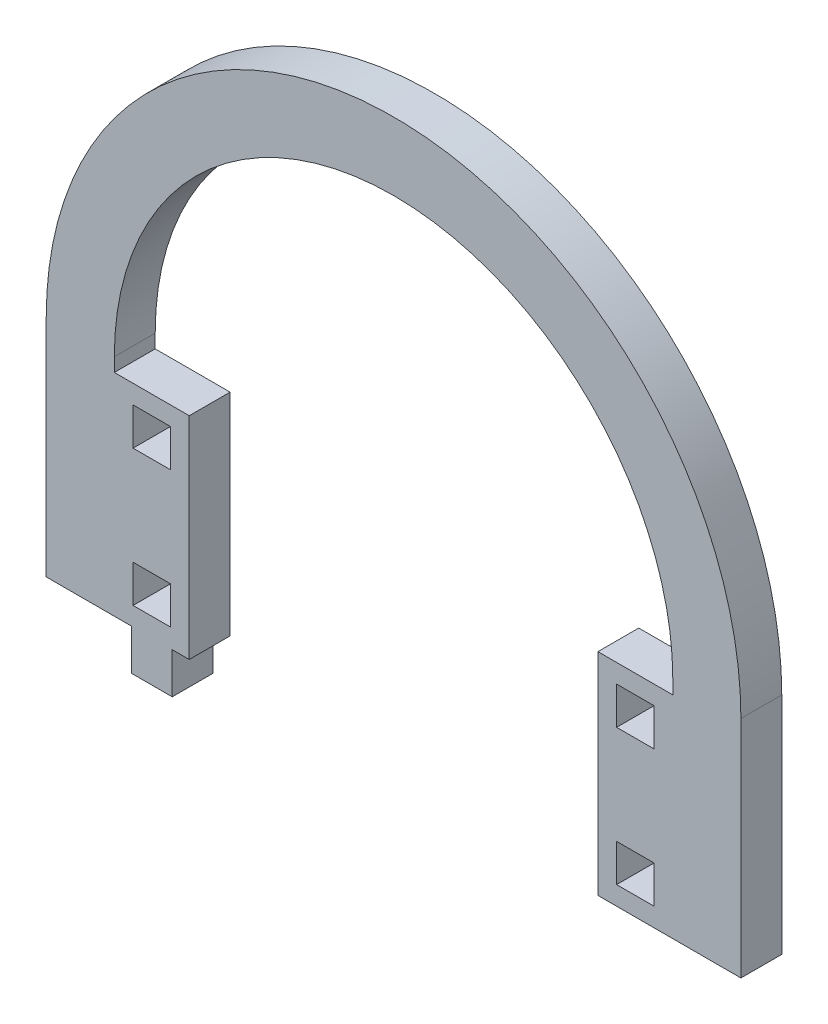
ISO-10303-21;
HEADER;
FILE_DESCRIPTION(('STEP AP214'),'2;1');
FILE_NAME('part.step','',(''),(''),'','','');
FILE_SCHEMA(('AUTOMOTIVE_DESIGN { 1 0 10303 214 1 1 1 1 }'));
ENDSEC;
DATA;
#1=APPLICATION_CONTEXT('core data for automotive mechanical design processes');
#2=APPLICATION_PROTOCOL_DEFINITION('international standard','automotive_design',2000,#1);
#3=PRODUCT_CONTEXT('',#1,'mechanical');
#4=PRODUCT('Part','Part','',(#3));
#5=PRODUCT_RELATED_PRODUCT_CATEGORY('part','',(#4));
#6=PRODUCT_DEFINITION_FORMATION('','',#4);
#7=PRODUCT_DEFINITION_CONTEXT('part definition',#1,'design');
#8=PRODUCT_DEFINITION('design','',#6,#7);
#9=PRODUCT_DEFINITION_SHAPE('','',#8);
#10=(LENGTH_UNIT() NAMED_UNIT(*) SI_UNIT(.MILLI.,.METRE.));
#11=(NAMED_UNIT(*) PLANE_ANGLE_UNIT() SI_UNIT($,.RADIAN.));
#12=(NAMED_UNIT(*) SI_UNIT($,.STERADIAN.) SOLID_ANGLE_UNIT());
#13=UNCERTAINTY_MEASURE_WITH_UNIT(LENGTH_MEASURE(1.E-05),#10,'distance_accuracy_value','');
#14=(GEOMETRIC_REPRESENTATION_CONTEXT(3) GLOBAL_UNCERTAINTY_ASSIGNED_CONTEXT((#13)) GLOBAL_UNIT_ASSIGNED_CONTEXT((#10,
#11,#12)) REPRESENTATION_CONTEXT('',''));
#15=CARTESIAN_POINT('',(0.,0.,0.));
#16=DIRECTION('',(0.,0.,1.));
#17=DIRECTION('',(1.,0.,0.));
#18=AXIS2_PLACEMENT_3D('',#15,#16,#17);
#19=CARTESIAN_POINT('',(3418.68426311956,1328.90302757437,6.));
#20=DIRECTION('',(0.,0.,1.));
#21=DIRECTION('',(1.,0.,0.));
#22=AXIS2_PLACEMENT_3D('',#19,#20,#21);
#23=PLANE('',#22);
#24=CARTESIAN_POINT('',(3418.68426311956,1328.90302757437,6.));
#25=DIRECTION('',(0.,0.,1.));
#26=DIRECTION('',(1.,0.,0.));
#27=AXIS2_PLACEMENT_3D('',#24,#25,#26);
#28=CIRCLE('',#27,50.9999999999999);
#29=CARTESIAN_POINT('',(3469.68426311956,1328.90302757437,6.));
#30=VERTEX_POINT('',#29);
#31=CARTESIAN_POINT('',(3367.68426311956,1328.90302757437,6.));
#32=VERTEX_POINT('',#31);
#33=EDGE_CURVE('E678',#30,#32,#28,.T.);
#34=ORIENTED_EDGE('',*,*,#33,.T.);
#35=DIRECTION('',(0.,-1.,0.));
#36=VECTOR('',#35,1.);
#37=CARTESIAN_POINT('',(3367.68426311956,1328.90302757437,6.));
#38=LINE('',#37,#36);
#39=CARTESIAN_POINT('',(3367.68426311956,1295.90302757437,6.));
#40=VERTEX_POINT('',#39);
#41=EDGE_CURVE('E682',#32,#40,#38,.T.);
#42=ORIENTED_EDGE('',*,*,#41,.T.);
#43=DIRECTION('',(1.,0.,0.));
#44=VECTOR('',#43,1.);
#45=CARTESIAN_POINT('',(3367.68426311956,1295.90302757437,6.));
#46=LINE('',#45,#44);
#47=CARTESIAN_POINT('',(3380.18426311956,1295.90302757437,6.));
#48=VERTEX_POINT('',#47);
#49=EDGE_CURVE('E686',#40,#48,#46,.T.);
#50=ORIENTED_EDGE('',*,*,#49,.T.);
#51=DIRECTION('',(0.,-1.,0.));
#52=VECTOR('',#51,1.);
#53=CARTESIAN_POINT('',(3380.18426311956,1295.90302757437,6.));
#54=LINE('',#53,#52);
#55=CARTESIAN_POINT('',(3380.18426311956,1289.90302757437,6.));
#56=VERTEX_POINT('',#55);
#57=EDGE_CURVE('E689',#48,#56,#54,.T.);
#58=ORIENTED_EDGE('',*,*,#57,.T.);
#59=DIRECTION('',(1.,0.,0.));
#60=VECTOR('',#59,1.);
#61=CARTESIAN_POINT('',(3380.18426311956,1289.90302757437,6.));
#62=LINE('',#61,#60);
#63=CARTESIAN_POINT('',(3386.18426311956,1289.90302757437,6.));
#64=VERTEX_POINT('',#63);
#65=EDGE_CURVE('E692',#56,#64,#62,.T.);
#66=ORIENTED_EDGE('',*,*,#65,.T.);
#67=DIRECTION('',(0.,1.,0.));
#68=VECTOR('',#67,1.);
#69=CARTESIAN_POINT('',(3386.18426311956,1289.90302757437,6.));
#70=LINE('',#69,#68);
#71=CARTESIAN_POINT('',(3386.18426311956,1295.90302757437,6.));
#72=VERTEX_POINT('',#71);
#73=EDGE_CURVE('E695',#64,#72,#70,.T.);
#74=ORIENTED_EDGE('',*,*,#73,.T.);
#75=DIRECTION('',(1.,0.,0.));
#76=VECTOR('',#75,1.);
#77=CARTESIAN_POINT('',(3386.18426311956,1295.90302757437,6.));
#78=LINE('',#77,#76);
#79=CARTESIAN_POINT('',(3388.68426311956,1295.90302757437,6.));
#80=VERTEX_POINT('',#79);
#81=EDGE_CURVE('E698',#72,#80,#78,.T.);
#82=ORIENTED_EDGE('',*,*,#81,.T.);
#83=DIRECTION('',(0.,-1.,0.));
#84=VECTOR('',#83,1.);
#85=CARTESIAN_POINT('',(3388.68426311956,1326.90302757437,6.));
#86=LINE('',#85,#84);
#87=CARTESIAN_POINT('',(3388.68426311956,1326.90302757437,6.));
#88=VERTEX_POINT('',#87);
#89=EDGE_CURVE('E701',#88,#80,#86,.T.);
#90=ORIENTED_EDGE('',*,*,#89,.F.);
#91=DIRECTION('',(-1.,0.,0.));
#92=VECTOR('',#91,1.);
#93=CARTESIAN_POINT('',(3388.68426311956,1326.90302757437,6.));
#94=LINE('',#93,#92);
#95=CARTESIAN_POINT('',(3377.68426311956,1326.90302757437,6.));
#96=VERTEX_POINT('',#95);
#97=EDGE_CURVE('E705',#88,#96,#94,.T.);
#98=ORIENTED_EDGE('',*,*,#97,.T.);
#99=DIRECTION('',(0.,-1.,0.));
#100=VECTOR('',#99,1.);
#101=CARTESIAN_POINT('',(3377.68426311956,1328.90302757437,6.));
#102=LINE('',#101,#100);
#103=CARTESIAN_POINT('',(3377.68426311956,1328.90302757437,6.));
#104=VERTEX_POINT('',#103);
#105=EDGE_CURVE('E708',#104,#96,#102,.T.);
#106=ORIENTED_EDGE('',*,*,#105,.F.);
#107=CARTESIAN_POINT('',(3418.68426311956,1328.90302757437,6.));
#108=DIRECTION('',(0.,0.,1.));
#109=DIRECTION('',(1.,0.,0.));
#110=AXIS2_PLACEMENT_3D('',#107,#108,#109);
#111=CIRCLE('',#110,41.0000000000001);
#112=CARTESIAN_POINT('',(3459.68426311956,1328.90302757437,6.));
#113=VERTEX_POINT('',#112);
#114=EDGE_CURVE('E712',#113,#104,#111,.T.);
#115=ORIENTED_EDGE('',*,*,#114,.F.);
#116=DIRECTION('',(0.,-1.,0.));
#117=VECTOR('',#116,1.);
#118=CARTESIAN_POINT('',(3459.68426311956,1328.90302757437,6.));
#119=LINE('',#118,#117);
#120=CARTESIAN_POINT('',(3459.68426311956,1326.90302757437,6.));
#121=VERTEX_POINT('',#120);
#122=EDGE_CURVE('E716',#113,#121,#119,.T.);
#123=ORIENTED_EDGE('',*,*,#122,.T.);
#124=DIRECTION('',(-1.,0.,0.));
#125=VECTOR('',#124,1.);
#126=CARTESIAN_POINT('',(3459.68426311956,1326.90302757437,6.));
#127=LINE('',#126,#125);
#128=CARTESIAN_POINT('',(3448.68426311956,1326.90302757437,6.));
#129=VERTEX_POINT('',#128);
#130=EDGE_CURVE('E719',#121,#129,#127,.T.);
#131=ORIENTED_EDGE('',*,*,#130,.T.);
#132=DIRECTION('',(0.,-1.,0.));
#133=VECTOR('',#132,1.);
#134=CARTESIAN_POINT('',(3448.68426311956,1326.90302757437,6.));
#135=LINE('',#134,#133);
#136=CARTESIAN_POINT('',(3448.68426311956,1295.90302757437,6.));
#137=VERTEX_POINT('',#136);
#138=EDGE_CURVE('E722',#129,#137,#135,.T.);
#139=ORIENTED_EDGE('',*,*,#138,.T.);
#140=DIRECTION('',(1.,0.,0.));
#141=VECTOR('',#140,1.);
#142=CARTESIAN_POINT('',(3448.68426311956,1295.90302757437,6.));
#143=LINE('',#142,#141);
#144=CARTESIAN_POINT('',(3469.68426311956,1295.90302757437,6.));
#145=VERTEX_POINT('',#144);
#146=EDGE_CURVE('E725',#137,#145,#143,.T.);
#147=ORIENTED_EDGE('',*,*,#146,.T.);
#148=DIRECTION('',(0.,-1.,0.));
#149=VECTOR('',#148,1.);
#150=CARTESIAN_POINT('',(3469.68426311956,1328.90302757437,6.));
#151=LINE('',#150,#149);
#152=EDGE_CURVE('E728',#30,#145,#151,.T.);
#153=ORIENTED_EDGE('',*,*,#152,.F.);
#154=EDGE_LOOP('',(#34,#42,#50,#58,#66,#74,#82,#90,#98,#106,#115,#123,#131,#139,#147,#153));
#155=FACE_BOUND('',#154,.T.);
#156=DIRECTION('',(0.,1.,0.));
#157=VECTOR('',#156,1.);
#158=CARTESIAN_POINT('',(3385.93426311956,0.,6.));
#159=LINE('',#158,#157);
#160=CARTESIAN_POINT('',(3385.93426311956,1318.65302757437,6.));
#161=VERTEX_POINT('',#160);
#162=CARTESIAN_POINT('',(3385.93426311956,1324.15302757437,6.));
#163=VERTEX_POINT('',#162);
#164=EDGE_CURVE('E638',#161,#163,#159,.T.);
#165=ORIENTED_EDGE('',*,*,#164,.F.);
#166=DIRECTION('',(1.,0.,0.));
#167=VECTOR('',#166,1.);
#168=CARTESIAN_POINT('',(0.,1318.65302757437,6.));
#169=LINE('',#168,#167);
#170=CARTESIAN_POINT('',(3380.43426311956,1318.65302757437,6.));
#171=VERTEX_POINT('',#170);
#172=EDGE_CURVE('E635',#171,#161,#169,.T.);
#173=ORIENTED_EDGE('',*,*,#172,.F.);
#174=DIRECTION('',(0.,-1.,0.));
#175=VECTOR('',#174,1.);
#176=CARTESIAN_POINT('',(3380.43426311956,0.,6.));
#177=LINE('',#176,#175);
#178=CARTESIAN_POINT('',(3380.43426311956,1324.15302757437,6.));
#179=VERTEX_POINT('',#178);
#180=EDGE_CURVE('E646',#179,#171,#177,.T.);
#181=ORIENTED_EDGE('',*,*,#180,.F.);
#182=DIRECTION('',(-1.,0.,0.));
#183=VECTOR('',#182,1.);
#184=CARTESIAN_POINT('',(0.,1324.15302757437,6.));
#185=LINE('',#184,#183);
#186=EDGE_CURVE('E642',#163,#179,#185,.T.);
#187=ORIENTED_EDGE('',*,*,#186,.F.);
#188=EDGE_LOOP('',(#165,#173,#181,#187));
#189=FACE_BOUND('',#188,.T.);
#190=DIRECTION('',(0.,1.,0.));
#191=VECTOR('',#190,1.);
#192=CARTESIAN_POINT('',(3385.93426311956,0.,6.));
#193=LINE('',#192,#191);
#194=CARTESIAN_POINT('',(3385.93426311956,1298.65302757437,6.));
#195=VERTEX_POINT('',#194);
#196=CARTESIAN_POINT('',(3385.93426311956,1304.15302757437,6.));
#197=VERTEX_POINT('',#196);
#198=EDGE_CURVE('E595',#195,#197,#193,.T.);
#199=ORIENTED_EDGE('',*,*,#198,.F.);
#200=DIRECTION('',(1.,0.,0.));
#201=VECTOR('',#200,1.);
#202=CARTESIAN_POINT('',(0.,1298.65302757437,6.));
#203=LINE('',#202,#201);
#204=CARTESIAN_POINT('',(3380.43426311956,1298.65302757437,6.));
#205=VERTEX_POINT('',#204);
#206=EDGE_CURVE('E592',#205,#195,#203,.T.);
#207=ORIENTED_EDGE('',*,*,#206,.F.);
#208=DIRECTION('',(0.,-1.,0.));
#209=VECTOR('',#208,1.);
#210=CARTESIAN_POINT('',(3380.43426311956,0.,6.));
#211=LINE('',#210,#209);
#212=CARTESIAN_POINT('',(3380.43426311956,1304.15302757437,6.));
#213=VERTEX_POINT('',#212);
#214=EDGE_CURVE('E603',#213,#205,#211,.T.);
#215=ORIENTED_EDGE('',*,*,#214,.F.);
#216=DIRECTION('',(-1.,0.,0.));
#217=VECTOR('',#216,1.);
#218=CARTESIAN_POINT('',(0.,1304.15302757437,6.));
#219=LINE('',#218,#217);
#220=EDGE_CURVE('E599',#197,#213,#219,.T.);
#221=ORIENTED_EDGE('',*,*,#220,.F.);
#222=EDGE_LOOP('',(#199,#207,#215,#221));
#223=FACE_BOUND('',#222,.T.);
#224=DIRECTION('',(0.,1.,0.));
#225=VECTOR('',#224,1.);
#226=CARTESIAN_POINT('',(3456.93426311956,0.,6.));
#227=LINE('',#226,#225);
#228=CARTESIAN_POINT('',(3456.93426311956,1318.65302757437,6.));
#229=VERTEX_POINT('',#228);
#230=CARTESIAN_POINT('',(3456.93426311956,1324.15302757437,6.));
#231=VERTEX_POINT('',#230);
#232=EDGE_CURVE('E552',#229,#231,#227,.T.);
#233=ORIENTED_EDGE('',*,*,#232,.F.);
#234=DIRECTION('',(1.,0.,0.));
#235=VECTOR('',#234,1.);
#236=CARTESIAN_POINT('',(0.,1318.65302757437,6.));
#237=LINE('',#236,#235);
#238=CARTESIAN_POINT('',(3451.43426311956,1318.65302757437,6.));
#239=VERTEX_POINT('',#238);
#240=EDGE_CURVE('E549',#239,#229,#237,.T.);
#241=ORIENTED_EDGE('',*,*,#240,.F.);
#242=DIRECTION('',(0.,-1.,0.));
#243=VECTOR('',#242,1.);
#244=CARTESIAN_POINT('',(3451.43426311956,0.,6.));
#245=LINE('',#244,#243);
#246=CARTESIAN_POINT('',(3451.43426311956,1324.15302757437,6.));
#247=VERTEX_POINT('',#246);
#248=EDGE_CURVE('E560',#247,#239,#245,.T.);
#249=ORIENTED_EDGE('',*,*,#248,.F.);
#250=DIRECTION('',(-1.,0.,0.));
#251=VECTOR('',#250,1.);
#252=CARTESIAN_POINT('',(0.,1324.15302757437,6.));
#253=LINE('',#252,#251);
#254=EDGE_CURVE('E556',#231,#247,#253,.T.);
#255=ORIENTED_EDGE('',*,*,#254,.F.);
#256=EDGE_LOOP('',(#233,#241,#249,#255));
#257=FACE_BOUND('',#256,.T.);
#258=DIRECTION('',(0.,1.,0.));
#259=VECTOR('',#258,1.);
#260=CARTESIAN_POINT('',(3456.93426311956,0.,6.));
#261=LINE('',#260,#259);
#262=CARTESIAN_POINT('',(3456.93426311956,1298.65302757437,6.));
#263=VERTEX_POINT('',#262);
#264=CARTESIAN_POINT('',(3456.93426311956,1304.15302757437,6.));
#265=VERTEX_POINT('',#264);
#266=EDGE_CURVE('E510',#263,#265,#261,.T.);
#267=ORIENTED_EDGE('',*,*,#266,.F.);
#268=DIRECTION('',(1.,0.,0.));
#269=VECTOR('',#268,1.);
#270=CARTESIAN_POINT('',(0.,1298.65302757437,6.));
#271=LINE('',#270,#269);
#272=CARTESIAN_POINT('',(3451.43426311956,1298.65302757437,6.));
#273=VERTEX_POINT('',#272);
#274=EDGE_CURVE('E501',#273,#263,#271,.T.);
#275=ORIENTED_EDGE('',*,*,#274,.F.);
#276=DIRECTION('',(0.,-1.,0.));
#277=VECTOR('',#276,1.);
#278=CARTESIAN_POINT('',(3451.43426311956,0.,6.));
#279=LINE('',#278,#277);
#280=CARTESIAN_POINT('',(3451.43426311956,1304.15302757437,6.));
#281=VERTEX_POINT('',#280);
#282=EDGE_CURVE('E527',#281,#273,#279,.T.);
#283=ORIENTED_EDGE('',*,*,#282,.F.);
#284=DIRECTION('',(-1.,0.,0.));
#285=VECTOR('',#284,1.);
#286=CARTESIAN_POINT('',(0.,1304.15302757437,6.));
#287=LINE('',#286,#285);
#288=EDGE_CURVE('E523',#265,#281,#287,.T.);
#289=ORIENTED_EDGE('',*,*,#288,.F.);
#290=EDGE_LOOP('',(#267,#275,#283,#289));
#291=FACE_BOUND('',#290,.T.);
#292=ADVANCED_FACE('F291',(#155,#189,#223,#257,#291),#23,.T.);
#293=CARTESIAN_POINT('',(3418.68426311956,1328.90302757437,0.));
#294=DIRECTION('',(0.,0.,1.));
#295=DIRECTION('',(1.,0.,0.));
#296=AXIS2_PLACEMENT_3D('',#293,#294,#295);
#297=PLANE('',#296);
#298=DIRECTION('',(1.,0.,0.));
#299=VECTOR('',#298,1.);
#300=CARTESIAN_POINT('',(0.,1318.65302757437,0.));
#301=LINE('',#300,#299);
#302=CARTESIAN_POINT('',(3451.43426311956,1318.65302757437,0.));
#303=VERTEX_POINT('',#302);
#304=CARTESIAN_POINT('',(3456.93426311956,1318.65302757437,0.));
#305=VERTEX_POINT('',#304);
#306=EDGE_CURVE('E519',#303,#305,#301,.T.);
#307=ORIENTED_EDGE('',*,*,#306,.T.);
#308=DIRECTION('',(0.,1.,0.));
#309=VECTOR('',#308,1.);
#310=CARTESIAN_POINT('',(3456.93426311956,0.,0.));
#311=LINE('',#310,#309);
#312=CARTESIAN_POINT('',(3456.93426311956,1324.15302757437,0.));
#313=VERTEX_POINT('',#312);
#314=EDGE_CURVE('E567',#305,#313,#311,.T.);
#315=ORIENTED_EDGE('',*,*,#314,.T.);
#316=DIRECTION('',(-1.,0.,0.));
#317=VECTOR('',#316,1.);
#318=CARTESIAN_POINT('',(0.,1324.15302757437,0.));
#319=LINE('',#318,#317);
#320=CARTESIAN_POINT('',(3451.43426311956,1324.15302757437,0.));
#321=VERTEX_POINT('',#320);
#322=EDGE_CURVE('E571',#313,#321,#319,.T.);
#323=ORIENTED_EDGE('',*,*,#322,.T.);
#324=DIRECTION('',(0.,-1.,0.));
#325=VECTOR('',#324,1.);
#326=CARTESIAN_POINT('',(3451.43426311956,0.,0.));
#327=LINE('',#326,#325);
#328=EDGE_CURVE('E553',#321,#303,#327,.T.);
#329=ORIENTED_EDGE('',*,*,#328,.T.);
#330=EDGE_LOOP('',(#307,#315,#323,#329));
#331=FACE_BOUND('',#330,.T.);
#332=DIRECTION('',(1.,0.,0.));
#333=VECTOR('',#332,1.);
#334=CARTESIAN_POINT('',(0.,1318.65302757437,0.));
#335=LINE('',#334,#333);
#336=CARTESIAN_POINT('',(3380.43426311956,1318.65302757437,0.));
#337=VERTEX_POINT('',#336);
#338=CARTESIAN_POINT('',(3385.93426311956,1318.65302757437,0.));
#339=VERTEX_POINT('',#338);
#340=EDGE_CURVE('E634',#337,#339,#335,.T.);
#341=ORIENTED_EDGE('',*,*,#340,.T.);
#342=DIRECTION('',(0.,1.,0.));
#343=VECTOR('',#342,1.);
#344=CARTESIAN_POINT('',(3385.93426311956,0.,0.));
#345=LINE('',#344,#343);
#346=CARTESIAN_POINT('',(3385.93426311956,1324.15302757437,0.));
#347=VERTEX_POINT('',#346);
#348=EDGE_CURVE('E653',#339,#347,#345,.T.);
#349=ORIENTED_EDGE('',*,*,#348,.T.);
#350=DIRECTION('',(-1.,0.,0.));
#351=VECTOR('',#350,1.);
#352=CARTESIAN_POINT('',(0.,1324.15302757437,0.));
#353=LINE('',#352,#351);
#354=CARTESIAN_POINT('',(3380.43426311956,1324.15302757437,0.));
#355=VERTEX_POINT('',#354);
#356=EDGE_CURVE('E657',#347,#355,#353,.T.);
#357=ORIENTED_EDGE('',*,*,#356,.T.);
#358=DIRECTION('',(0.,-1.,0.));
#359=VECTOR('',#358,1.);
#360=CARTESIAN_POINT('',(3380.43426311956,0.,0.));
#361=LINE('',#360,#359);
#362=EDGE_CURVE('E639',#355,#337,#361,.T.);
#363=ORIENTED_EDGE('',*,*,#362,.T.);
#364=EDGE_LOOP('',(#341,#349,#357,#363));
#365=FACE_BOUND('',#364,.T.);
#366=CARTESIAN_POINT('',(3418.68426311956,1328.90302757437,0.));
#367=DIRECTION('',(0.,0.,1.));
#368=DIRECTION('',(1.,0.,0.));
#369=AXIS2_PLACEMENT_3D('',#366,#367,#368);
#370=CIRCLE('',#369,50.9999999999999);
#371=CARTESIAN_POINT('',(3469.68426311956,1328.90302757437,0.));
#372=VERTEX_POINT('',#371);
#373=CARTESIAN_POINT('',(3367.68426311956,1328.90302757437,0.));
#374=VERTEX_POINT('',#373);
#375=EDGE_CURVE('E677',#372,#374,#370,.T.);
#376=ORIENTED_EDGE('',*,*,#375,.F.);
#377=DIRECTION('',(0.,-1.,0.));
#378=VECTOR('',#377,1.);
#379=CARTESIAN_POINT('',(3469.68426311956,1328.90302757437,0.));
#380=LINE('',#379,#378);
#381=CARTESIAN_POINT('',(3469.68426311956,1295.90302757437,0.));
#382=VERTEX_POINT('',#381);
#383=EDGE_CURVE('E683',#372,#382,#380,.T.);
#384=ORIENTED_EDGE('',*,*,#383,.T.);
#385=DIRECTION('',(1.,0.,0.));
#386=VECTOR('',#385,1.);
#387=CARTESIAN_POINT('',(3459.68426311956,1295.90302757437,0.));
#388=LINE('',#387,#386);
#389=CARTESIAN_POINT('',(3448.68426311956,1295.90302757437,0.));
#390=VERTEX_POINT('',#389);
#391=EDGE_CURVE('E781',#390,#382,#388,.T.);
#392=ORIENTED_EDGE('',*,*,#391,.F.);
#393=DIRECTION('',(0.,-1.,0.));
#394=VECTOR('',#393,1.);
#395=CARTESIAN_POINT('',(3448.68426311956,1326.90302757437,0.));
#396=LINE('',#395,#394);
#397=CARTESIAN_POINT('',(3448.68426311956,1326.90302757437,0.));
#398=VERTEX_POINT('',#397);
#399=EDGE_CURVE('E777',#398,#390,#396,.T.);
#400=ORIENTED_EDGE('',*,*,#399,.F.);
#401=DIRECTION('',(-1.,0.,0.));
#402=VECTOR('',#401,1.);
#403=CARTESIAN_POINT('',(3459.68426311956,1326.90302757437,0.));
#404=LINE('',#403,#402);
#405=CARTESIAN_POINT('',(3459.68426311956,1326.90302757437,0.));
#406=VERTEX_POINT('',#405);
#407=EDGE_CURVE('E774',#406,#398,#404,.T.);
#408=ORIENTED_EDGE('',*,*,#407,.F.);
#409=DIRECTION('',(0.,-1.,0.));
#410=VECTOR('',#409,1.);
#411=CARTESIAN_POINT('',(3459.68426311956,1328.90302757437,0.));
#412=LINE('',#411,#410);
#413=CARTESIAN_POINT('',(3459.68426311956,1328.90302757437,0.));
#414=VERTEX_POINT('',#413);
#415=EDGE_CURVE('E771',#414,#406,#412,.T.);
#416=ORIENTED_EDGE('',*,*,#415,.F.);
#417=CARTESIAN_POINT('',(3418.68426311956,1328.90302757437,0.));
#418=DIRECTION('',(0.,0.,1.));
#419=DIRECTION('',(1.,0.,0.));
#420=AXIS2_PLACEMENT_3D('',#417,#418,#419);
#421=CIRCLE('',#420,41.0000000000001);
#422=CARTESIAN_POINT('',(3377.68426311956,1328.90302757437,0.));
#423=VERTEX_POINT('',#422);
#424=EDGE_CURVE('E767',#414,#423,#421,.T.);
#425=ORIENTED_EDGE('',*,*,#424,.T.);
#426=DIRECTION('',(0.,-1.,0.));
#427=VECTOR('',#426,1.);
#428=CARTESIAN_POINT('',(3377.68426311956,1328.90302757437,0.));
#429=LINE('',#428,#427);
#430=CARTESIAN_POINT('',(3377.68426311956,1326.90302757437,0.));
#431=VERTEX_POINT('',#430);
#432=EDGE_CURVE('E763',#423,#431,#429,.T.);
#433=ORIENTED_EDGE('',*,*,#432,.T.);
#434=DIRECTION('',(-1.,0.,0.));
#435=VECTOR('',#434,1.);
#436=CARTESIAN_POINT('',(3388.68426311956,1326.90302757437,0.));
#437=LINE('',#436,#435);
#438=CARTESIAN_POINT('',(3388.68426311956,1326.90302757437,0.));
#439=VERTEX_POINT('',#438);
#440=EDGE_CURVE('E759',#439,#431,#437,.T.);
#441=ORIENTED_EDGE('',*,*,#440,.F.);
#442=DIRECTION('',(0.,-1.,0.));
#443=VECTOR('',#442,1.);
#444=CARTESIAN_POINT('',(3388.68426311956,1326.90302757437,0.));
#445=LINE('',#444,#443);
#446=CARTESIAN_POINT('',(3388.68426311956,1295.90302757437,0.));
#447=VERTEX_POINT('',#446);
#448=EDGE_CURVE('E755',#439,#447,#445,.T.);
#449=ORIENTED_EDGE('',*,*,#448,.T.);
#450=DIRECTION('',(1.,0.,0.));
#451=VECTOR('',#450,1.);
#452=CARTESIAN_POINT('',(3386.18426311956,1295.90302757437,0.));
#453=LINE('',#452,#451);
#454=CARTESIAN_POINT('',(3386.18426311956,1295.90302757437,0.));
#455=VERTEX_POINT('',#454);
#456=EDGE_CURVE('E751',#455,#447,#453,.T.);
#457=ORIENTED_EDGE('',*,*,#456,.F.);
#458=DIRECTION('',(0.,1.,0.));
#459=VECTOR('',#458,1.);
#460=CARTESIAN_POINT('',(3386.18426311956,1289.90302757437,0.));
#461=LINE('',#460,#459);
#462=CARTESIAN_POINT('',(3386.18426311956,1289.90302757437,0.));
#463=VERTEX_POINT('',#462);
#464=EDGE_CURVE('E748',#463,#455,#461,.T.);
#465=ORIENTED_EDGE('',*,*,#464,.F.);
#466=DIRECTION('',(1.,0.,0.));
#467=VECTOR('',#466,1.);
#468=CARTESIAN_POINT('',(3380.18426311956,1289.90302757437,0.));
#469=LINE('',#468,#467);
#470=CARTESIAN_POINT('',(3380.18426311956,1289.90302757437,0.));
#471=VERTEX_POINT('',#470);
#472=EDGE_CURVE('E745',#471,#463,#469,.T.);
#473=ORIENTED_EDGE('',*,*,#472,.F.);
#474=DIRECTION('',(0.,-1.,0.));
#475=VECTOR('',#474,1.);
#476=CARTESIAN_POINT('',(3380.18426311956,1295.90302757437,0.));
#477=LINE('',#476,#475);
#478=CARTESIAN_POINT('',(3380.18426311956,1295.90302757437,0.));
#479=VERTEX_POINT('',#478);
#480=EDGE_CURVE('E742',#479,#471,#477,.T.);
#481=ORIENTED_EDGE('',*,*,#480,.F.);
#482=DIRECTION('',(1.,0.,0.));
#483=VECTOR('',#482,1.);
#484=CARTESIAN_POINT('',(3367.68426311956,1295.90302757437,0.));
#485=LINE('',#484,#483);
#486=CARTESIAN_POINT('',(3367.68426311956,1295.90302757437,0.));
#487=VERTEX_POINT('',#486);
#488=EDGE_CURVE('E739',#487,#479,#485,.T.);
#489=ORIENTED_EDGE('',*,*,#488,.F.);
#490=DIRECTION('',(0.,-1.,0.));
#491=VECTOR('',#490,1.);
#492=CARTESIAN_POINT('',(3367.68426311956,1328.90302757437,0.));
#493=LINE('',#492,#491);
#494=EDGE_CURVE('E736',#374,#487,#493,.T.);
#495=ORIENTED_EDGE('',*,*,#494,.F.);
#496=EDGE_LOOP('',(#376,#384,#392,#400,#408,#416,#425,#433,#441,#449,#457,#465,#473,#481,#489,#495));
#497=FACE_BOUND('',#496,.T.);
#498=DIRECTION('',(1.,0.,0.));
#499=VECTOR('',#498,1.);
#500=CARTESIAN_POINT('',(0.,1298.65302757437,0.));
#501=LINE('',#500,#499);
#502=CARTESIAN_POINT('',(3380.43426311956,1298.65302757437,0.));
#503=VERTEX_POINT('',#502);
#504=CARTESIAN_POINT('',(3385.93426311956,1298.65302757437,0.));
#505=VERTEX_POINT('',#504);
#506=EDGE_CURVE('E591',#503,#505,#501,.T.);
#507=ORIENTED_EDGE('',*,*,#506,.T.);
#508=DIRECTION('',(0.,1.,0.));
#509=VECTOR('',#508,1.);
#510=CARTESIAN_POINT('',(3385.93426311956,0.,0.));
#511=LINE('',#510,#509);
#512=CARTESIAN_POINT('',(3385.93426311956,1304.15302757437,0.));
#513=VERTEX_POINT('',#512);
#514=EDGE_CURVE('E610',#505,#513,#511,.T.);
#515=ORIENTED_EDGE('',*,*,#514,.T.);
#516=DIRECTION('',(-1.,0.,0.));
#517=VECTOR('',#516,1.);
#518=CARTESIAN_POINT('',(0.,1304.15302757437,0.));
#519=LINE('',#518,#517);
#520=CARTESIAN_POINT('',(3380.43426311956,1304.15302757437,0.));
#521=VERTEX_POINT('',#520);
#522=EDGE_CURVE('E614',#513,#521,#519,.T.);
#523=ORIENTED_EDGE('',*,*,#522,.T.);
#524=DIRECTION('',(0.,-1.,0.));
#525=VECTOR('',#524,1.);
#526=CARTESIAN_POINT('',(3380.43426311956,0.,0.));
#527=LINE('',#526,#525);
#528=EDGE_CURVE('E596',#521,#503,#527,.T.);
#529=ORIENTED_EDGE('',*,*,#528,.T.);
#530=EDGE_LOOP('',(#507,#515,#523,#529));
#531=FACE_BOUND('',#530,.T.);
#532=DIRECTION('',(1.,0.,0.));
#533=VECTOR('',#532,1.);
#534=CARTESIAN_POINT('',(0.,1298.65302757437,0.));
#535=LINE('',#534,#533);
#536=CARTESIAN_POINT('',(3451.43426311956,1298.65302757437,0.));
#537=VERTEX_POINT('',#536);
#538=CARTESIAN_POINT('',(3456.93426311956,1298.65302757437,0.));
#539=VERTEX_POINT('',#538);
#540=EDGE_CURVE('E315',#537,#539,#535,.T.);
#541=ORIENTED_EDGE('',*,*,#540,.T.);
#542=DIRECTION('',(0.,1.,0.));
#543=VECTOR('',#542,1.);
#544=CARTESIAN_POINT('',(3456.93426311956,0.,0.));
#545=LINE('',#544,#543);
#546=CARTESIAN_POINT('',(3456.93426311956,1304.15302757437,0.));
#547=VERTEX_POINT('',#546);
#548=EDGE_CURVE('E517',#539,#547,#545,.T.);
#549=ORIENTED_EDGE('',*,*,#548,.T.);
#550=DIRECTION('',(-1.,0.,0.));
#551=VECTOR('',#550,1.);
#552=CARTESIAN_POINT('',(0.,1304.15302757437,0.));
#553=LINE('',#552,#551);
#554=CARTESIAN_POINT('',(3451.43426311956,1304.15302757437,0.));
#555=VERTEX_POINT('',#554);
#556=EDGE_CURVE('E536',#547,#555,#553,.T.);
#557=ORIENTED_EDGE('',*,*,#556,.T.);
#558=DIRECTION('',(0.,-1.,0.));
#559=VECTOR('',#558,1.);
#560=CARTESIAN_POINT('',(3451.43426311956,0.,0.));
#561=LINE('',#560,#559);
#562=EDGE_CURVE('E511',#555,#537,#561,.T.);
#563=ORIENTED_EDGE('',*,*,#562,.T.);
#564=EDGE_LOOP('',(#541,#549,#557,#563));
#565=FACE_BOUND('',#564,.T.);
#566=ADVANCED_FACE('F847',(#331,#365,#497,#531,#565),#297,.F.);
#567=CARTESIAN_POINT('',(3418.68426311956,1328.90302757437,6.));
#568=DIRECTION('',(0.,0.,-1.));
#569=DIRECTION('',(-1.,0.,0.));
#570=AXIS2_PLACEMENT_3D('',#567,#568,#569);
#571=CYLINDRICAL_SURFACE('',#570,50.9999999999999);
#572=ORIENTED_EDGE('',*,*,#375,.T.);
#573=DIRECTION('',(0.,0.,-1.));
#574=VECTOR('',#573,1.);
#575=CARTESIAN_POINT('',(3367.68426311956,1328.90302757437,6.));
#576=LINE('',#575,#574);
#577=EDGE_CURVE('E12',#32,#374,#576,.T.);
#578=ORIENTED_EDGE('',*,*,#577,.F.);
#579=ORIENTED_EDGE('',*,*,#33,.F.);
#580=DIRECTION('',(0.,0.,-1.));
#581=VECTOR('',#580,1.);
#582=CARTESIAN_POINT('',(3469.68426311956,1328.90302757437,6.));
#583=LINE('',#582,#581);
#584=EDGE_CURVE('E732',#30,#372,#583,.T.);
#585=ORIENTED_EDGE('',*,*,#584,.T.);
#586=EDGE_LOOP('',(#572,#578,#579,#585));
#587=FACE_BOUND('',#586,.T.);
#588=ADVANCED_FACE('F293',(#587),#571,.T.);
#589=CARTESIAN_POINT('',(3367.68426311956,1328.90302757437,6.));
#590=DIRECTION('',(1.,0.,0.));
#591=DIRECTION('',(0.,0.,-1.));
#592=AXIS2_PLACEMENT_3D('',#589,#590,#591);
#593=PLANE('',#592);
#594=ORIENTED_EDGE('',*,*,#494,.T.);
#595=DIRECTION('',(0.,0.,-1.));
#596=VECTOR('',#595,1.);
#597=CARTESIAN_POINT('',(3367.68426311956,1295.90302757437,6.));
#598=LINE('',#597,#596);
#599=EDGE_CURVE('E300',#40,#487,#598,.T.);
#600=ORIENTED_EDGE('',*,*,#599,.F.);
#601=ORIENTED_EDGE('',*,*,#41,.F.);
#602=ORIENTED_EDGE('',*,*,#577,.T.);
#603=EDGE_LOOP('',(#594,#600,#601,#602));
#604=FACE_BOUND('',#603,.T.);
#605=ADVANCED_FACE('F866',(#604),#593,.F.);
#606=CARTESIAN_POINT('',(3367.68426311956,1295.90302757437,6.));
#607=DIRECTION('',(0.,1.,0.));
#608=DIRECTION('',(0.,0.,1.));
#609=AXIS2_PLACEMENT_3D('',#606,#607,#608);
#610=PLANE('',#609);
#611=ORIENTED_EDGE('',*,*,#488,.T.);
#612=DIRECTION('',(0.,0.,-1.));
#613=VECTOR('',#612,1.);
#614=CARTESIAN_POINT('',(3380.18426311956,1295.90302757437,6.));
#615=LINE('',#614,#613);
#616=EDGE_CURVE('E832',#48,#479,#615,.T.);
#617=ORIENTED_EDGE('',*,*,#616,.F.);
#618=ORIENTED_EDGE('',*,*,#49,.F.);
#619=ORIENTED_EDGE('',*,*,#599,.T.);
#620=EDGE_LOOP('',(#611,#617,#618,#619));
#621=FACE_BOUND('',#620,.T.);
#622=ADVANCED_FACE('F841',(#621),#610,.F.);
#623=CARTESIAN_POINT('',(3380.18426311956,1295.90302757437,6.));
#624=DIRECTION('',(1.,0.,0.));
#625=DIRECTION('',(0.,0.,-1.));
#626=AXIS2_PLACEMENT_3D('',#623,#624,#625);
#627=PLANE('',#626);
#628=ORIENTED_EDGE('',*,*,#480,.T.);
#629=DIRECTION('',(0.,0.,-1.));
#630=VECTOR('',#629,1.);
#631=CARTESIAN_POINT('',(3380.18426311956,1289.90302757437,6.));
#632=LINE('',#631,#630);
#633=EDGE_CURVE('E828',#56,#471,#632,.T.);
#634=ORIENTED_EDGE('',*,*,#633,.F.);
#635=ORIENTED_EDGE('',*,*,#57,.F.);
#636=ORIENTED_EDGE('',*,*,#616,.T.);
#637=EDGE_LOOP('',(#628,#634,#635,#636));
#638=FACE_BOUND('',#637,.T.);
#639=ADVANCED_FACE('F853',(#638),#627,.F.);
#640=CARTESIAN_POINT('',(3380.18426311956,1289.90302757437,6.));
#641=DIRECTION('',(0.,1.,0.));
#642=DIRECTION('',(0.,0.,1.));
#643=AXIS2_PLACEMENT_3D('',#640,#641,#642);
#644=PLANE('',#643);
#645=ORIENTED_EDGE('',*,*,#472,.T.);
#646=DIRECTION('',(0.,0.,-1.));
#647=VECTOR('',#646,1.);
#648=CARTESIAN_POINT('',(3386.18426311956,1289.90302757437,6.));
#649=LINE('',#648,#647);
#650=EDGE_CURVE('E824',#64,#463,#649,.T.);
#651=ORIENTED_EDGE('',*,*,#650,.F.);
#652=ORIENTED_EDGE('',*,*,#65,.F.);
#653=ORIENTED_EDGE('',*,*,#633,.T.);
#654=EDGE_LOOP('',(#645,#651,#652,#653));
#655=FACE_BOUND('',#654,.T.);
#656=ADVANCED_FACE('F857',(#655),#644,.F.);
#657=CARTESIAN_POINT('',(3386.18426311956,1289.90302757437,6.));
#658=DIRECTION('',(-1.,0.,0.));
#659=DIRECTION('',(0.,0.,1.));
#660=AXIS2_PLACEMENT_3D('',#657,#658,#659);
#661=PLANE('',#660);
#662=ORIENTED_EDGE('',*,*,#464,.T.);
#663=DIRECTION('',(0.,0.,-1.));
#664=VECTOR('',#663,1.);
#665=CARTESIAN_POINT('',(3386.18426311956,1295.90302757437,6.));
#666=LINE('',#665,#664);
#667=EDGE_CURVE('E820',#72,#455,#666,.T.);
#668=ORIENTED_EDGE('',*,*,#667,.F.);
#669=ORIENTED_EDGE('',*,*,#73,.F.);
#670=ORIENTED_EDGE('',*,*,#650,.T.);
#671=EDGE_LOOP('',(#662,#668,#669,#670));
#672=FACE_BOUND('',#671,.T.);
#673=ADVANCED_FACE('F911',(#672),#661,.F.);
#674=CARTESIAN_POINT('',(3386.18426311956,1295.90302757437,6.));
#675=DIRECTION('',(0.,1.,0.));
#676=DIRECTION('',(0.,0.,1.));
#677=AXIS2_PLACEMENT_3D('',#674,#675,#676);
#678=PLANE('',#677);
#679=ORIENTED_EDGE('',*,*,#456,.T.);
#680=DIRECTION('',(0.,0.,-1.));
#681=VECTOR('',#680,1.);
#682=CARTESIAN_POINT('',(3388.68426311956,1295.90302757437,6.));
#683=LINE('',#682,#681);
#684=EDGE_CURVE('E817',#80,#447,#683,.T.);
#685=ORIENTED_EDGE('',*,*,#684,.F.);
#686=ORIENTED_EDGE('',*,*,#81,.F.);
#687=ORIENTED_EDGE('',*,*,#667,.T.);
#688=EDGE_LOOP('',(#679,#685,#686,#687));
#689=FACE_BOUND('',#688,.T.);
#690=ADVANCED_FACE('F909',(#689),#678,.F.);
#691=CARTESIAN_POINT('',(3388.68426311956,1326.90302757437,6.));
#692=DIRECTION('',(1.,0.,0.));
#693=DIRECTION('',(0.,0.,-1.));
#694=AXIS2_PLACEMENT_3D('',#691,#692,#693);
#695=PLANE('',#694);
#696=ORIENTED_EDGE('',*,*,#448,.F.);
#697=DIRECTION('',(0.,0.,-1.));
#698=VECTOR('',#697,1.);
#699=CARTESIAN_POINT('',(3388.68426311956,1326.90302757437,6.));
#700=LINE('',#699,#698);
#701=EDGE_CURVE('E814',#88,#439,#700,.T.);
#702=ORIENTED_EDGE('',*,*,#701,.F.);
#703=ORIENTED_EDGE('',*,*,#89,.T.);
#704=ORIENTED_EDGE('',*,*,#684,.T.);
#705=EDGE_LOOP('',(#696,#702,#703,#704));
#706=FACE_BOUND('',#705,.T.);
#707=ADVANCED_FACE('F903',(#706),#695,.T.);
#708=CARTESIAN_POINT('',(3388.68426311956,1326.90302757437,6.));
#709=DIRECTION('',(0.,-1.,0.));
#710=DIRECTION('',(0.,0.,-1.));
#711=AXIS2_PLACEMENT_3D('',#708,#709,#710);
#712=PLANE('',#711);
#713=ORIENTED_EDGE('',*,*,#440,.T.);
#714=DIRECTION('',(0.,0.,-1.));
#715=VECTOR('',#714,1.);
#716=CARTESIAN_POINT('',(3377.68426311956,1326.90302757437,6.));
#717=LINE('',#716,#715);
#718=EDGE_CURVE('E811',#96,#431,#717,.T.);
#719=ORIENTED_EDGE('',*,*,#718,.F.);
#720=ORIENTED_EDGE('',*,*,#97,.F.);
#721=ORIENTED_EDGE('',*,*,#701,.T.);
#722=EDGE_LOOP('',(#713,#719,#720,#721));
#723=FACE_BOUND('',#722,.T.);
#724=ADVANCED_FACE('F912',(#723),#712,.F.);
#725=CARTESIAN_POINT('',(3377.68426311956,1328.90302757437,6.));
#726=DIRECTION('',(1.,0.,0.));
#727=DIRECTION('',(0.,0.,-1.));
#728=AXIS2_PLACEMENT_3D('',#725,#726,#727);
#729=PLANE('',#728);
#730=ORIENTED_EDGE('',*,*,#432,.F.);
#731=DIRECTION('',(0.,0.,-1.));
#732=VECTOR('',#731,1.);
#733=CARTESIAN_POINT('',(3377.68426311956,1328.90302757437,6.));
#734=LINE('',#733,#732);
#735=EDGE_CURVE('E808',#104,#423,#734,.T.);
#736=ORIENTED_EDGE('',*,*,#735,.F.);
#737=ORIENTED_EDGE('',*,*,#105,.T.);
#738=ORIENTED_EDGE('',*,*,#718,.T.);
#739=EDGE_LOOP('',(#730,#736,#737,#738));
#740=FACE_BOUND('',#739,.T.);
#741=ADVANCED_FACE('F896',(#740),#729,.T.);
#742=CARTESIAN_POINT('',(3418.68426311956,1328.90302757437,6.));
#743=DIRECTION('',(0.,0.,-1.));
#744=DIRECTION('',(-1.,0.,0.));
#745=AXIS2_PLACEMENT_3D('',#742,#743,#744);
#746=CYLINDRICAL_SURFACE('',#745,41.0000000000001);
#747=ORIENTED_EDGE('',*,*,#424,.F.);
#748=DIRECTION('',(0.,0.,-1.));
#749=VECTOR('',#748,1.);
#750=CARTESIAN_POINT('',(3459.68426311956,1328.90302757437,6.));
#751=LINE('',#750,#749);
#752=EDGE_CURVE('E805',#113,#414,#751,.T.);
#753=ORIENTED_EDGE('',*,*,#752,.F.);
#754=ORIENTED_EDGE('',*,*,#114,.T.);
#755=ORIENTED_EDGE('',*,*,#735,.T.);
#756=EDGE_LOOP('',(#747,#753,#754,#755));
#757=FACE_BOUND('',#756,.T.);
#758=ADVANCED_FACE('F890',(#757),#746,.F.);
#759=CARTESIAN_POINT('',(3459.68426311956,1328.90302757437,6.));
#760=DIRECTION('',(1.,0.,0.));
#761=DIRECTION('',(0.,0.,-1.));
#762=AXIS2_PLACEMENT_3D('',#759,#760,#761);
#763=PLANE('',#762);
#764=ORIENTED_EDGE('',*,*,#415,.T.);
#765=DIRECTION('',(0.,0.,-1.));
#766=VECTOR('',#765,1.);
#767=CARTESIAN_POINT('',(3459.68426311956,1326.90302757437,6.));
#768=LINE('',#767,#766);
#769=EDGE_CURVE('E801',#121,#406,#768,.T.);
#770=ORIENTED_EDGE('',*,*,#769,.F.);
#771=ORIENTED_EDGE('',*,*,#122,.F.);
#772=ORIENTED_EDGE('',*,*,#752,.T.);
#773=EDGE_LOOP('',(#764,#770,#771,#772));
#774=FACE_BOUND('',#773,.T.);
#775=ADVANCED_FACE('F940',(#774),#763,.F.);
#776=CARTESIAN_POINT('',(3459.68426311956,1326.90302757437,6.));
#777=DIRECTION('',(0.,-1.,0.));
#778=DIRECTION('',(0.,0.,-1.));
#779=AXIS2_PLACEMENT_3D('',#776,#777,#778);
#780=PLANE('',#779);
#781=ORIENTED_EDGE('',*,*,#407,.T.);
#782=DIRECTION('',(0.,0.,-1.));
#783=VECTOR('',#782,1.);
#784=CARTESIAN_POINT('',(3448.68426311956,1326.90302757437,6.));
#785=LINE('',#784,#783);
#786=EDGE_CURVE('E797',#129,#398,#785,.T.);
#787=ORIENTED_EDGE('',*,*,#786,.F.);
#788=ORIENTED_EDGE('',*,*,#130,.F.);
#789=ORIENTED_EDGE('',*,*,#769,.T.);
#790=EDGE_LOOP('',(#781,#787,#788,#789));
#791=FACE_BOUND('',#790,.T.);
#792=ADVANCED_FACE('F884',(#791),#780,.F.);
#793=CARTESIAN_POINT('',(3448.68426311956,1326.90302757437,6.));
#794=DIRECTION('',(1.,0.,0.));
#795=DIRECTION('',(0.,0.,-1.));
#796=AXIS2_PLACEMENT_3D('',#793,#794,#795);
#797=PLANE('',#796);
#798=ORIENTED_EDGE('',*,*,#399,.T.);
#799=DIRECTION('',(0.,0.,-1.));
#800=VECTOR('',#799,1.);
#801=CARTESIAN_POINT('',(3448.68426311956,1295.90302757437,6.));
#802=LINE('',#801,#800);
#803=EDGE_CURVE('E793',#137,#390,#802,.T.);
#804=ORIENTED_EDGE('',*,*,#803,.F.);
#805=ORIENTED_EDGE('',*,*,#138,.F.);
#806=ORIENTED_EDGE('',*,*,#786,.T.);
#807=EDGE_LOOP('',(#798,#804,#805,#806));
#808=FACE_BOUND('',#807,.T.);
#809=ADVANCED_FACE('F879',(#808),#797,.F.);
#810=CARTESIAN_POINT('',(3459.68426311956,1295.90302757437,6.));
#811=DIRECTION('',(0.,1.,0.));
#812=DIRECTION('',(0.,0.,1.));
#813=AXIS2_PLACEMENT_3D('',#810,#811,#812);
#814=PLANE('',#813);
#815=ORIENTED_EDGE('',*,*,#391,.T.);
#816=DIRECTION('',(0.,0.,-1.));
#817=VECTOR('',#816,1.);
#818=CARTESIAN_POINT('',(3469.68426311956,1295.90302757437,6.));
#819=LINE('',#818,#817);
#820=EDGE_CURVE('E790',#145,#382,#819,.T.);
#821=ORIENTED_EDGE('',*,*,#820,.F.);
#822=ORIENTED_EDGE('',*,*,#146,.F.);
#823=ORIENTED_EDGE('',*,*,#803,.T.);
#824=EDGE_LOOP('',(#815,#821,#822,#823));
#825=FACE_BOUND('',#824,.T.);
#826=ADVANCED_FACE('F874',(#825),#814,.F.);
#827=CARTESIAN_POINT('',(3469.68426311956,1328.90302757437,6.));
#828=DIRECTION('',(1.,0.,0.));
#829=DIRECTION('',(0.,1.,0.));
#830=AXIS2_PLACEMENT_3D('',#827,#828,#829);
#831=PLANE('',#830);
#832=ORIENTED_EDGE('',*,*,#383,.F.);
#833=ORIENTED_EDGE('',*,*,#584,.F.);
#834=ORIENTED_EDGE('',*,*,#152,.T.);
#835=ORIENTED_EDGE('',*,*,#820,.T.);
#836=EDGE_LOOP('',(#832,#833,#834,#835));
#837=FACE_BOUND('',#836,.T.);
#838=ADVANCED_FACE('F870',(#837),#831,.T.);
#839=CARTESIAN_POINT('',(0.,1318.65302757437,6.));
#840=DIRECTION('',(0.,1.,0.));
#841=DIRECTION('',(0.,0.,1.));
#842=AXIS2_PLACEMENT_3D('',#839,#840,#841);
#843=PLANE('',#842);
#844=ORIENTED_EDGE('',*,*,#340,.F.);
#845=DIRECTION('',(0.,0.,-1.));
#846=VECTOR('',#845,1.);
#847=CARTESIAN_POINT('',(3380.43426311956,1318.65302757437,6.));
#848=LINE('',#847,#846);
#849=EDGE_CURVE('E649',#171,#337,#848,.T.);
#850=ORIENTED_EDGE('',*,*,#849,.F.);
#851=ORIENTED_EDGE('',*,*,#172,.T.);
#852=DIRECTION('',(0.,0.,-1.));
#853=VECTOR('',#852,1.);
#854=CARTESIAN_POINT('',(3385.93426311956,1318.65302757437,6.));
#855=LINE('',#854,#853);
#856=EDGE_CURVE('E673',#161,#339,#855,.T.);
#857=ORIENTED_EDGE('',*,*,#856,.T.);
#858=EDGE_LOOP('',(#844,#850,#851,#857));
#859=FACE_BOUND('',#858,.T.);
#860=ADVANCED_FACE('F929',(#859),#843,.T.);
#861=CARTESIAN_POINT('',(3385.93426311956,0.,6.));
#862=DIRECTION('',(-1.,0.,0.));
#863=DIRECTION('',(0.,0.,1.));
#864=AXIS2_PLACEMENT_3D('',#861,#862,#863);
#865=PLANE('',#864);
#866=ORIENTED_EDGE('',*,*,#348,.F.);
#867=ORIENTED_EDGE('',*,*,#856,.F.);
#868=ORIENTED_EDGE('',*,*,#164,.T.);
#869=DIRECTION('',(0.,0.,-1.));
#870=VECTOR('',#869,1.);
#871=CARTESIAN_POINT('',(3385.93426311956,1324.15302757437,6.));
#872=LINE('',#871,#870);
#873=EDGE_CURVE('E670',#163,#347,#872,.T.);
#874=ORIENTED_EDGE('',*,*,#873,.T.);
#875=EDGE_LOOP('',(#866,#867,#868,#874));
#876=FACE_BOUND('',#875,.T.);
#877=ADVANCED_FACE('F974',(#876),#865,.T.);
#878=CARTESIAN_POINT('',(0.,1324.15302757437,6.));
#879=DIRECTION('',(0.,-1.,0.));
#880=DIRECTION('',(0.,0.,-1.));
#881=AXIS2_PLACEMENT_3D('',#878,#879,#880);
#882=PLANE('',#881);
#883=ORIENTED_EDGE('',*,*,#356,.F.);
#884=ORIENTED_EDGE('',*,*,#873,.F.);
#885=ORIENTED_EDGE('',*,*,#186,.T.);
#886=DIRECTION('',(0.,0.,-1.));
#887=VECTOR('',#886,1.);
#888=CARTESIAN_POINT('',(3380.43426311956,1324.15302757437,6.));
#889=LINE('',#888,#887);
#890=EDGE_CURVE('E667',#179,#355,#889,.T.);
#891=ORIENTED_EDGE('',*,*,#890,.T.);
#892=EDGE_LOOP('',(#883,#884,#885,#891));
#893=FACE_BOUND('',#892,.T.);
#894=ADVANCED_FACE('F981',(#893),#882,.T.);
#895=CARTESIAN_POINT('',(3380.43426311956,0.,6.));
#896=DIRECTION('',(1.,0.,0.));
#897=DIRECTION('',(0.,0.,-1.));
#898=AXIS2_PLACEMENT_3D('',#895,#896,#897);
#899=PLANE('',#898);
#900=ORIENTED_EDGE('',*,*,#362,.F.);
#901=ORIENTED_EDGE('',*,*,#890,.F.);
#902=ORIENTED_EDGE('',*,*,#180,.T.);
#903=ORIENTED_EDGE('',*,*,#849,.T.);
#904=EDGE_LOOP('',(#900,#901,#902,#903));
#905=FACE_BOUND('',#904,.T.);
#906=ADVANCED_FACE('F988',(#905),#899,.T.);
#907=CARTESIAN_POINT('',(0.,1298.65302757437,6.));
#908=DIRECTION('',(0.,1.,0.));
#909=DIRECTION('',(0.,0.,1.));
#910=AXIS2_PLACEMENT_3D('',#907,#908,#909);
#911=PLANE('',#910);
#912=ORIENTED_EDGE('',*,*,#506,.F.);
#913=DIRECTION('',(0.,0.,-1.));
#914=VECTOR('',#913,1.);
#915=CARTESIAN_POINT('',(3380.43426311956,1298.65302757437,6.));
#916=LINE('',#915,#914);
#917=EDGE_CURVE('E606',#205,#503,#916,.T.);
#918=ORIENTED_EDGE('',*,*,#917,.F.);
#919=ORIENTED_EDGE('',*,*,#206,.T.);
#920=DIRECTION('',(0.,0.,-1.));
#921=VECTOR('',#920,1.);
#922=CARTESIAN_POINT('',(3385.93426311956,1298.65302757437,6.));
#923=LINE('',#922,#921);
#924=EDGE_CURVE('E630',#195,#505,#923,.T.);
#925=ORIENTED_EDGE('',*,*,#924,.T.);
#926=EDGE_LOOP('',(#912,#918,#919,#925));
#927=FACE_BOUND('',#926,.T.);
#928=ADVANCED_FACE('F996',(#927),#911,.T.);
#929=CARTESIAN_POINT('',(3385.93426311956,0.,6.));
#930=DIRECTION('',(-1.,0.,0.));
#931=DIRECTION('',(0.,0.,1.));
#932=AXIS2_PLACEMENT_3D('',#929,#930,#931);
#933=PLANE('',#932);
#934=ORIENTED_EDGE('',*,*,#514,.F.);
#935=ORIENTED_EDGE('',*,*,#924,.F.);
#936=ORIENTED_EDGE('',*,*,#198,.T.);
#937=DIRECTION('',(0.,0.,-1.));
#938=VECTOR('',#937,1.);
#939=CARTESIAN_POINT('',(3385.93426311956,1304.15302757437,6.));
#940=LINE('',#939,#938);
#941=EDGE_CURVE('E627',#197,#513,#940,.T.);
#942=ORIENTED_EDGE('',*,*,#941,.T.);
#943=EDGE_LOOP('',(#934,#935,#936,#942));
#944=FACE_BOUND('',#943,.T.);
#945=ADVANCED_FACE('F1004',(#944),#933,.T.);
#946=CARTESIAN_POINT('',(0.,1304.15302757437,6.));
#947=DIRECTION('',(0.,-1.,0.));
#948=DIRECTION('',(0.,0.,-1.));
#949=AXIS2_PLACEMENT_3D('',#946,#947,#948);
#950=PLANE('',#949);
#951=ORIENTED_EDGE('',*,*,#522,.F.);
#952=ORIENTED_EDGE('',*,*,#941,.F.);
#953=ORIENTED_EDGE('',*,*,#220,.T.);
#954=DIRECTION('',(0.,0.,-1.));
#955=VECTOR('',#954,1.);
#956=CARTESIAN_POINT('',(3380.43426311956,1304.15302757437,6.));
#957=LINE('',#956,#955);
#958=EDGE_CURVE('E624',#213,#521,#957,.T.);
#959=ORIENTED_EDGE('',*,*,#958,.T.);
#960=EDGE_LOOP('',(#951,#952,#953,#959));
#961=FACE_BOUND('',#960,.T.);
#962=ADVANCED_FACE('F1012',(#961),#950,.T.);
#963=CARTESIAN_POINT('',(3380.43426311956,0.,6.));
#964=DIRECTION('',(1.,0.,0.));
#965=DIRECTION('',(0.,0.,-1.));
#966=AXIS2_PLACEMENT_3D('',#963,#964,#965);
#967=PLANE('',#966);
#968=ORIENTED_EDGE('',*,*,#528,.F.);
#969=ORIENTED_EDGE('',*,*,#958,.F.);
#970=ORIENTED_EDGE('',*,*,#214,.T.);
#971=ORIENTED_EDGE('',*,*,#917,.T.);
#972=EDGE_LOOP('',(#968,#969,#970,#971));
#973=FACE_BOUND('',#972,.T.);
#974=ADVANCED_FACE('F1020',(#973),#967,.T.);
#975=CARTESIAN_POINT('',(0.,1318.65302757437,6.));
#976=DIRECTION('',(0.,1.,0.));
#977=DIRECTION('',(0.,0.,1.));
#978=AXIS2_PLACEMENT_3D('',#975,#976,#977);
#979=PLANE('',#978);
#980=ORIENTED_EDGE('',*,*,#306,.F.);
#981=DIRECTION('',(0.,0.,-1.));
#982=VECTOR('',#981,1.);
#983=CARTESIAN_POINT('',(3451.43426311956,1318.65302757437,6.));
#984=LINE('',#983,#982);
#985=EDGE_CURVE('E563',#239,#303,#984,.T.);
#986=ORIENTED_EDGE('',*,*,#985,.F.);
#987=ORIENTED_EDGE('',*,*,#240,.T.);
#988=DIRECTION('',(0.,0.,-1.));
#989=VECTOR('',#988,1.);
#990=CARTESIAN_POINT('',(3456.93426311956,1318.65302757437,6.));
#991=LINE('',#990,#989);
#992=EDGE_CURVE('E587',#229,#305,#991,.T.);
#993=ORIENTED_EDGE('',*,*,#992,.T.);
#994=EDGE_LOOP('',(#980,#986,#987,#993));
#995=FACE_BOUND('',#994,.T.);
#996=ADVANCED_FACE('F1028',(#995),#979,.T.);
#997=CARTESIAN_POINT('',(3456.93426311956,0.,6.));
#998=DIRECTION('',(-1.,0.,0.));
#999=DIRECTION('',(0.,0.,1.));
#1000=AXIS2_PLACEMENT_3D('',#997,#998,#999);
#1001=PLANE('',#1000);
#1002=ORIENTED_EDGE('',*,*,#314,.F.);
#1003=ORIENTED_EDGE('',*,*,#992,.F.);
#1004=ORIENTED_EDGE('',*,*,#232,.T.);
#1005=DIRECTION('',(0.,0.,-1.));
#1006=VECTOR('',#1005,1.);
#1007=CARTESIAN_POINT('',(3456.93426311956,1324.15302757437,6.));
#1008=LINE('',#1007,#1006);
#1009=EDGE_CURVE('E584',#231,#313,#1008,.T.);
#1010=ORIENTED_EDGE('',*,*,#1009,.T.);
#1011=EDGE_LOOP('',(#1002,#1003,#1004,#1010));
#1012=FACE_BOUND('',#1011,.T.);
#1013=ADVANCED_FACE('F1036',(#1012),#1001,.T.);
#1014=CARTESIAN_POINT('',(0.,1324.15302757437,6.));
#1015=DIRECTION('',(0.,-1.,0.));
#1016=DIRECTION('',(0.,0.,-1.));
#1017=AXIS2_PLACEMENT_3D('',#1014,#1015,#1016);
#1018=PLANE('',#1017);
#1019=ORIENTED_EDGE('',*,*,#322,.F.);
#1020=ORIENTED_EDGE('',*,*,#1009,.F.);
#1021=ORIENTED_EDGE('',*,*,#254,.T.);
#1022=DIRECTION('',(0.,0.,-1.));
#1023=VECTOR('',#1022,1.);
#1024=CARTESIAN_POINT('',(3451.43426311956,1324.15302757437,6.));
#1025=LINE('',#1024,#1023);
#1026=EDGE_CURVE('E581',#247,#321,#1025,.T.);
#1027=ORIENTED_EDGE('',*,*,#1026,.T.);
#1028=EDGE_LOOP('',(#1019,#1020,#1021,#1027));
#1029=FACE_BOUND('',#1028,.T.);
#1030=ADVANCED_FACE('F1044',(#1029),#1018,.T.);
#1031=CARTESIAN_POINT('',(3451.43426311956,0.,6.));
#1032=DIRECTION('',(1.,0.,0.));
#1033=DIRECTION('',(0.,0.,-1.));
#1034=AXIS2_PLACEMENT_3D('',#1031,#1032,#1033);
#1035=PLANE('',#1034);
#1036=ORIENTED_EDGE('',*,*,#328,.F.);
#1037=ORIENTED_EDGE('',*,*,#1026,.F.);
#1038=ORIENTED_EDGE('',*,*,#248,.T.);
#1039=ORIENTED_EDGE('',*,*,#985,.T.);
#1040=EDGE_LOOP('',(#1036,#1037,#1038,#1039));
#1041=FACE_BOUND('',#1040,.T.);
#1042=ADVANCED_FACE('F1052',(#1041),#1035,.T.);
#1043=CARTESIAN_POINT('',(0.,1298.65302757437,6.));
#1044=DIRECTION('',(0.,1.,0.));
#1045=DIRECTION('',(0.,0.,1.));
#1046=AXIS2_PLACEMENT_3D('',#1043,#1044,#1045);
#1047=PLANE('',#1046);
#1048=ORIENTED_EDGE('',*,*,#540,.F.);
#1049=DIRECTION('',(0.,0.,-1.));
#1050=VECTOR('',#1049,1.);
#1051=CARTESIAN_POINT('',(3451.43426311956,1298.65302757437,6.));
#1052=LINE('',#1051,#1050);
#1053=EDGE_CURVE('E505',#273,#537,#1052,.T.);
#1054=ORIENTED_EDGE('',*,*,#1053,.F.);
#1055=ORIENTED_EDGE('',*,*,#274,.T.);
#1056=DIRECTION('',(0.,0.,-1.));
#1057=VECTOR('',#1056,1.);
#1058=CARTESIAN_POINT('',(3456.93426311956,1298.65302757437,6.));
#1059=LINE('',#1058,#1057);
#1060=EDGE_CURVE('E504',#263,#539,#1059,.T.);
#1061=ORIENTED_EDGE('',*,*,#1060,.T.);
#1062=EDGE_LOOP('',(#1048,#1054,#1055,#1061));
#1063=FACE_BOUND('',#1062,.T.);
#1064=ADVANCED_FACE('F503',(#1063),#1047,.T.);
#1065=CARTESIAN_POINT('',(3456.93426311956,0.,6.));
#1066=DIRECTION('',(-1.,0.,0.));
#1067=DIRECTION('',(0.,0.,1.));
#1068=AXIS2_PLACEMENT_3D('',#1065,#1066,#1067);
#1069=PLANE('',#1068);
#1070=ORIENTED_EDGE('',*,*,#548,.F.);
#1071=ORIENTED_EDGE('',*,*,#1060,.F.);
#1072=ORIENTED_EDGE('',*,*,#266,.T.);
#1073=DIRECTION('',(0.,0.,-1.));
#1074=VECTOR('',#1073,1.);
#1075=CARTESIAN_POINT('',(3456.93426311956,1304.15302757437,6.));
#1076=LINE('',#1075,#1074);
#1077=EDGE_CURVE('E520',#265,#547,#1076,.T.);
#1078=ORIENTED_EDGE('',*,*,#1077,.T.);
#1079=EDGE_LOOP('',(#1070,#1071,#1072,#1078));
#1080=FACE_BOUND('',#1079,.T.);
#1081=ADVANCED_FACE('F514',(#1080),#1069,.T.);
#1082=CARTESIAN_POINT('',(0.,1304.15302757437,6.));
#1083=DIRECTION('',(0.,-1.,0.));
#1084=DIRECTION('',(0.,0.,-1.));
#1085=AXIS2_PLACEMENT_3D('',#1082,#1083,#1084);
#1086=PLANE('',#1085);
#1087=ORIENTED_EDGE('',*,*,#556,.F.);
#1088=ORIENTED_EDGE('',*,*,#1077,.F.);
#1089=ORIENTED_EDGE('',*,*,#288,.T.);
#1090=DIRECTION('',(0.,0.,-1.));
#1091=VECTOR('',#1090,1.);
#1092=CARTESIAN_POINT('',(3451.43426311956,1304.15302757437,6.));
#1093=LINE('',#1092,#1091);
#1094=EDGE_CURVE('E307',#281,#555,#1093,.T.);
#1095=ORIENTED_EDGE('',*,*,#1094,.T.);
#1096=EDGE_LOOP('',(#1087,#1088,#1089,#1095));
#1097=FACE_BOUND('',#1096,.T.);
#1098=ADVANCED_FACE('F1073',(#1097),#1086,.T.);
#1099=CARTESIAN_POINT('',(3451.43426311956,0.,6.));
#1100=DIRECTION('',(1.,0.,0.));
#1101=DIRECTION('',(0.,0.,-1.));
#1102=AXIS2_PLACEMENT_3D('',#1099,#1100,#1101);
#1103=PLANE('',#1102);
#1104=ORIENTED_EDGE('',*,*,#562,.F.);
#1105=ORIENTED_EDGE('',*,*,#1094,.F.);
#1106=ORIENTED_EDGE('',*,*,#282,.T.);
#1107=ORIENTED_EDGE('',*,*,#1053,.T.);
#1108=EDGE_LOOP('',(#1104,#1105,#1106,#1107));
#1109=FACE_BOUND('',#1108,.T.);
#1110=ADVANCED_FACE('F1080',(#1109),#1103,.T.);
#1111=CLOSED_SHELL('',(#292,#566,#588,#605,#622,#639,#656,#673,#690,#707,#724,#741,#758,#775,
#792,#809,#826,#838,#860,#877,#894,#906,#928,#945,#962,#974,#996,#1013,#1030,#1042,#1064,#1081,
#1098,#1110));
#1112=MANIFOLD_SOLID_BREP('B2',#1111);
#1113=ADVANCED_BREP_SHAPE_REPRESENTATION('',(#18,#1112),#14);
#1114=SHAPE_DEFINITION_REPRESENTATION(#9,#1113);
ENDSEC;
END-ISO-10303-21;
